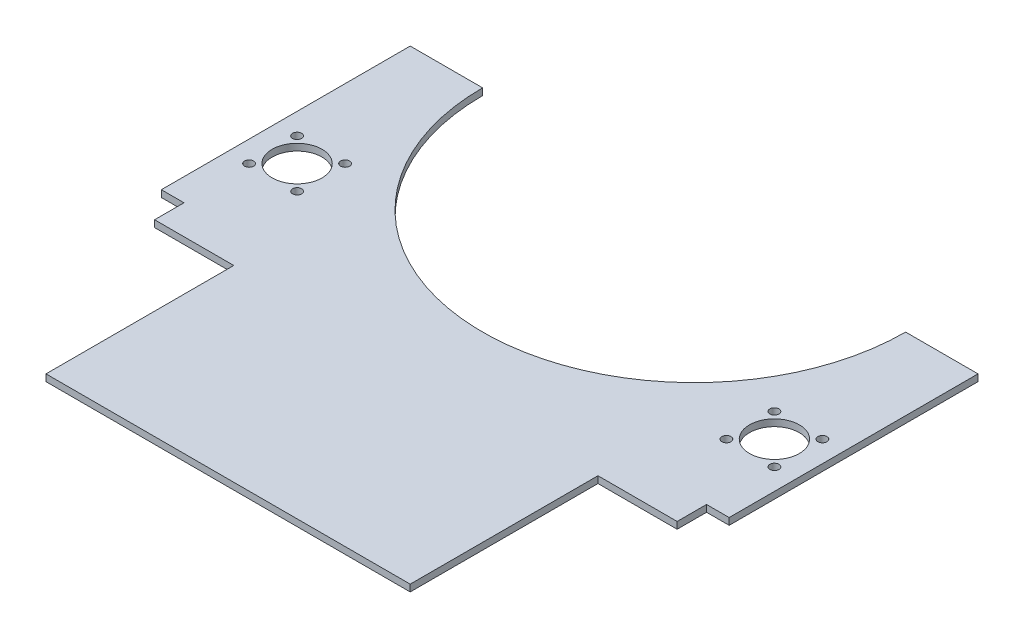
ISO-10303-21;
HEADER;
FILE_DESCRIPTION(('STEP AP214'),'2;1');
FILE_NAME('part.step','',(''),(''),'','','');
FILE_SCHEMA(('AUTOMOTIVE_DESIGN { 1 0 10303 214 1 1 1 1 }'));
ENDSEC;
DATA;
#1=APPLICATION_CONTEXT('core data for automotive mechanical design processes');
#2=APPLICATION_PROTOCOL_DEFINITION('international standard','automotive_design',2000,#1);
#3=PRODUCT_CONTEXT('',#1,'mechanical');
#4=PRODUCT('Part','Part','',(#3));
#5=PRODUCT_RELATED_PRODUCT_CATEGORY('part','',(#4));
#6=PRODUCT_DEFINITION_FORMATION('','',#4);
#7=PRODUCT_DEFINITION_CONTEXT('part definition',#1,'design');
#8=PRODUCT_DEFINITION('design','',#6,#7);
#9=PRODUCT_DEFINITION_SHAPE('','',#8);
#10=(LENGTH_UNIT() NAMED_UNIT(*) SI_UNIT(.MILLI.,.METRE.));
#11=(NAMED_UNIT(*) PLANE_ANGLE_UNIT() SI_UNIT($,.RADIAN.));
#12=(NAMED_UNIT(*) SI_UNIT($,.STERADIAN.) SOLID_ANGLE_UNIT());
#13=UNCERTAINTY_MEASURE_WITH_UNIT(LENGTH_MEASURE(1.E-05),#10,'distance_accuracy_value','');
#14=(GEOMETRIC_REPRESENTATION_CONTEXT(3) GLOBAL_UNCERTAINTY_ASSIGNED_CONTEXT((#13)) GLOBAL_UNIT_ASSIGNED_CONTEXT((#10,
#11,#12)) REPRESENTATION_CONTEXT('',''));
#15=CARTESIAN_POINT('',(0.,0.,0.));
#16=DIRECTION('',(0.,0.,1.));
#17=DIRECTION('',(1.,0.,0.));
#18=AXIS2_PLACEMENT_3D('',#15,#16,#17);
#19=CARTESIAN_POINT('',(0.,3.,-206.));
#20=DIRECTION('',(0.,-1.,0.));
#21=DIRECTION('',(0.,0.,-1.));
#22=AXIS2_PLACEMENT_3D('',#19,#20,#21);
#23=PLANE('',#22);
#24=CARTESIAN_POINT('',(116.11,3.,-146.61));
#25=DIRECTION('',(0.,1.,0.));
#26=DIRECTION('',(0.,0.,-1.));
#27=AXIS2_PLACEMENT_3D('',#24,#25,#26);
#28=CIRCLE('',#27,2.);
#29=CARTESIAN_POINT('',(116.11,3.,-148.61));
#30=VERTEX_POINT('',#29);
#31=EDGE_CURVE('E340',#30,#30,#28,.T.);
#32=ORIENTED_EDGE('',*,*,#31,.F.);
#33=EDGE_LOOP('',(#32));
#34=FACE_BOUND('',#33,.T.);
#35=CARTESIAN_POINT('',(94.8900000000001,3.,-125.39));
#36=DIRECTION('',(0.,1.,0.));
#37=DIRECTION('',(0.,0.,-1.));
#38=AXIS2_PLACEMENT_3D('',#35,#36,#37);
#39=CIRCLE('',#38,2.);
#40=CARTESIAN_POINT('',(94.8900000000001,3.,-127.39));
#41=VERTEX_POINT('',#40);
#42=EDGE_CURVE('E352',#41,#41,#39,.T.);
#43=ORIENTED_EDGE('',*,*,#42,.F.);
#44=EDGE_LOOP('',(#43));
#45=FACE_BOUND('',#44,.T.);
#46=CARTESIAN_POINT('',(-94.8900000000001,3.,-146.61));
#47=DIRECTION('',(0.,1.,0.));
#48=DIRECTION('',(0.,0.,-1.));
#49=AXIS2_PLACEMENT_3D('',#46,#47,#48);
#50=CIRCLE('',#49,2.);
#51=CARTESIAN_POINT('',(-94.8900000000001,3.,-148.61));
#52=VERTEX_POINT('',#51);
#53=EDGE_CURVE('E364',#52,#52,#50,.T.);
#54=ORIENTED_EDGE('',*,*,#53,.F.);
#55=EDGE_LOOP('',(#54));
#56=FACE_BOUND('',#55,.T.);
#57=CARTESIAN_POINT('',(-116.11,3.,-125.39));
#58=DIRECTION('',(0.,1.,0.));
#59=DIRECTION('',(0.,0.,-1.));
#60=AXIS2_PLACEMENT_3D('',#57,#58,#59);
#61=CIRCLE('',#60,2.);
#62=CARTESIAN_POINT('',(-116.11,3.,-127.39));
#63=VERTEX_POINT('',#62);
#64=EDGE_CURVE('E376',#63,#63,#61,.T.);
#65=ORIENTED_EDGE('',*,*,#64,.F.);
#66=EDGE_LOOP('',(#65));
#67=FACE_BOUND('',#66,.T.);
#68=CARTESIAN_POINT('',(-105.5,3.,-136.));
#69=DIRECTION('',(0.,1.,0.));
#70=DIRECTION('',(0.,0.,1.));
#71=AXIS2_PLACEMENT_3D('',#68,#69,#70);
#72=CIRCLE('',#71,11.);
#73=CARTESIAN_POINT('',(-105.5,3.,-125.));
#74=VERTEX_POINT('',#73);
#75=EDGE_CURVE('E168',#74,#74,#72,.T.);
#76=ORIENTED_EDGE('',*,*,#75,.F.);
#77=EDGE_LOOP('',(#76));
#78=FACE_BOUND('',#77,.T.);
#79=DIRECTION('',(0.,0.,-1.));
#80=VECTOR('',#79,1.);
#81=CARTESIAN_POINT('',(80.5,3.,0.));
#82=LINE('',#81,#80);
#83=CARTESIAN_POINT('',(80.5,3.,0.));
#84=VERTEX_POINT('',#83);
#85=CARTESIAN_POINT('',(80.5,3.,-83.));
#86=VERTEX_POINT('',#85);
#87=EDGE_CURVE('E191',#84,#86,#82,.T.);
#88=ORIENTED_EDGE('',*,*,#87,.T.);
#89=DIRECTION('',(1.,0.,0.));
#90=VECTOR('',#89,1.);
#91=CARTESIAN_POINT('',(80.5,3.,-83.));
#92=LINE('',#91,#90);
#93=CARTESIAN_POINT('',(115.5,3.,-83.));
#94=VERTEX_POINT('',#93);
#95=EDGE_CURVE('E109',#86,#94,#92,.T.);
#96=ORIENTED_EDGE('',*,*,#95,.T.);
#97=DIRECTION('',(0.,0.,-1.));
#98=VECTOR('',#97,1.);
#99=CARTESIAN_POINT('',(115.5,3.,-83.));
#100=LINE('',#99,#98);
#101=CARTESIAN_POINT('',(115.5,3.,-96.));
#102=VERTEX_POINT('',#101);
#103=EDGE_CURVE('E224',#94,#102,#100,.T.);
#104=ORIENTED_EDGE('',*,*,#103,.T.);
#105=DIRECTION('',(1.,0.,0.));
#106=VECTOR('',#105,1.);
#107=CARTESIAN_POINT('',(115.5,3.,-96.));
#108=LINE('',#107,#106);
#109=CARTESIAN_POINT('',(125.5,3.,-96.));
#110=VERTEX_POINT('',#109);
#111=EDGE_CURVE('E243',#102,#110,#108,.T.);
#112=ORIENTED_EDGE('',*,*,#111,.T.);
#113=DIRECTION('',(0.,0.,-1.));
#114=VECTOR('',#113,1.);
#115=CARTESIAN_POINT('',(125.5,3.,-96.));
#116=LINE('',#115,#114);
#117=CARTESIAN_POINT('',(125.5,3.,-206.));
#118=VERTEX_POINT('',#117);
#119=EDGE_CURVE('E240',#110,#118,#116,.T.);
#120=ORIENTED_EDGE('',*,*,#119,.T.);
#121=DIRECTION('',(-1.,0.,0.));
#122=VECTOR('',#121,1.);
#123=CARTESIAN_POINT('',(125.5,3.,-206.));
#124=LINE('',#123,#122);
#125=CARTESIAN_POINT('',(93.5000000000001,3.,-206.));
#126=VERTEX_POINT('',#125);
#127=EDGE_CURVE('E242',#118,#126,#124,.T.);
#128=ORIENTED_EDGE('',*,*,#127,.T.);
#129=CARTESIAN_POINT('',(0.,3.,-206.));
#130=DIRECTION('',(0.,-1.,0.));
#131=DIRECTION('',(0.,0.,-1.));
#132=AXIS2_PLACEMENT_3D('',#129,#130,#131);
#133=CIRCLE('',#132,93.5000000000001);
#134=CARTESIAN_POINT('',(-93.5000000000001,3.,-206.));
#135=VERTEX_POINT('',#134);
#136=EDGE_CURVE('E245',#126,#135,#133,.T.);
#137=ORIENTED_EDGE('',*,*,#136,.T.);
#138=DIRECTION('',(-1.,0.,0.));
#139=VECTOR('',#138,1.);
#140=CARTESIAN_POINT('',(-125.5,3.,-206.));
#141=LINE('',#140,#139);
#142=CARTESIAN_POINT('',(-125.5,3.,-206.));
#143=VERTEX_POINT('',#142);
#144=EDGE_CURVE('E251',#135,#143,#141,.T.);
#145=ORIENTED_EDGE('',*,*,#144,.T.);
#146=DIRECTION('',(0.,0.,1.));
#147=VECTOR('',#146,1.);
#148=CARTESIAN_POINT('',(-125.5,3.,-96.));
#149=LINE('',#148,#147);
#150=CARTESIAN_POINT('',(-125.5,3.,-96.));
#151=VERTEX_POINT('',#150);
#152=EDGE_CURVE('E253',#143,#151,#149,.T.);
#153=ORIENTED_EDGE('',*,*,#152,.T.);
#154=DIRECTION('',(1.,0.,0.));
#155=VECTOR('',#154,1.);
#156=CARTESIAN_POINT('',(-115.5,3.,-96.));
#157=LINE('',#156,#155);
#158=CARTESIAN_POINT('',(-115.5,3.,-96.));
#159=VERTEX_POINT('',#158);
#160=EDGE_CURVE('E255',#151,#159,#157,.T.);
#161=ORIENTED_EDGE('',*,*,#160,.T.);
#162=DIRECTION('',(0.,0.,1.));
#163=VECTOR('',#162,1.);
#164=CARTESIAN_POINT('',(-115.5,3.,-83.));
#165=LINE('',#164,#163);
#166=CARTESIAN_POINT('',(-115.5,3.,-83.));
#167=VERTEX_POINT('',#166);
#168=EDGE_CURVE('E146',#159,#167,#165,.T.);
#169=ORIENTED_EDGE('',*,*,#168,.T.);
#170=DIRECTION('',(1.,0.,0.));
#171=VECTOR('',#170,1.);
#172=CARTESIAN_POINT('',(-80.5,3.,-83.));
#173=LINE('',#172,#171);
#174=CARTESIAN_POINT('',(-80.5,3.,-83.));
#175=VERTEX_POINT('',#174);
#176=EDGE_CURVE('E140',#167,#175,#173,.T.);
#177=ORIENTED_EDGE('',*,*,#176,.T.);
#178=DIRECTION('',(0.,0.,1.));
#179=VECTOR('',#178,1.);
#180=CARTESIAN_POINT('',(-80.5,3.,0.));
#181=LINE('',#180,#179);
#182=CARTESIAN_POINT('',(-80.5,3.,0.));
#183=VERTEX_POINT('',#182);
#184=EDGE_CURVE('E144',#175,#183,#181,.T.);
#185=ORIENTED_EDGE('',*,*,#184,.T.);
#186=DIRECTION('',(1.,0.,0.));
#187=VECTOR('',#186,1.);
#188=CARTESIAN_POINT('',(80.5,3.,0.));
#189=LINE('',#188,#187);
#190=EDGE_CURVE('E48',#183,#84,#189,.T.);
#191=ORIENTED_EDGE('',*,*,#190,.T.);
#192=EDGE_LOOP('',(#88,#96,#104,#112,#120,#128,#137,#145,#153,#161,#169,#177,#185,#191));
#193=FACE_BOUND('',#192,.T.);
#194=CARTESIAN_POINT('',(-116.11,3.,-146.61));
#195=DIRECTION('',(0.,1.,0.));
#196=DIRECTION('',(0.,0.,1.));
#197=AXIS2_PLACEMENT_3D('',#194,#195,#196);
#198=CIRCLE('',#197,2.);
#199=CARTESIAN_POINT('',(-116.11,3.,-144.61));
#200=VERTEX_POINT('',#199);
#201=EDGE_CURVE('E382',#200,#200,#198,.T.);
#202=ORIENTED_EDGE('',*,*,#201,.F.);
#203=EDGE_LOOP('',(#202));
#204=FACE_BOUND('',#203,.T.);
#205=CARTESIAN_POINT('',(-94.8900000000001,3.,-125.39));
#206=DIRECTION('',(0.,1.,0.));
#207=DIRECTION('',(0.,0.,1.));
#208=AXIS2_PLACEMENT_3D('',#205,#206,#207);
#209=CIRCLE('',#208,2.);
#210=CARTESIAN_POINT('',(-94.8900000000001,3.,-123.39));
#211=VERTEX_POINT('',#210);
#212=EDGE_CURVE('E370',#211,#211,#209,.T.);
#213=ORIENTED_EDGE('',*,*,#212,.F.);
#214=EDGE_LOOP('',(#213));
#215=FACE_BOUND('',#214,.T.);
#216=CARTESIAN_POINT('',(94.89,3.,-146.61));
#217=DIRECTION('',(0.,1.,0.));
#218=DIRECTION('',(0.,0.,1.));
#219=AXIS2_PLACEMENT_3D('',#216,#217,#218);
#220=CIRCLE('',#219,2.);
#221=CARTESIAN_POINT('',(94.89,3.,-144.61));
#222=VERTEX_POINT('',#221);
#223=EDGE_CURVE('E358',#222,#222,#220,.T.);
#224=ORIENTED_EDGE('',*,*,#223,.F.);
#225=EDGE_LOOP('',(#224));
#226=FACE_BOUND('',#225,.T.);
#227=CARTESIAN_POINT('',(116.11,3.,-125.39));
#228=DIRECTION('',(0.,1.,0.));
#229=DIRECTION('',(0.,0.,1.));
#230=AXIS2_PLACEMENT_3D('',#227,#228,#229);
#231=CIRCLE('',#230,2.);
#232=CARTESIAN_POINT('',(116.11,3.,-123.39));
#233=VERTEX_POINT('',#232);
#234=EDGE_CURVE('E346',#233,#233,#231,.T.);
#235=ORIENTED_EDGE('',*,*,#234,.F.);
#236=EDGE_LOOP('',(#235));
#237=FACE_BOUND('',#236,.T.);
#238=CARTESIAN_POINT('',(105.5,3.,-136.));
#239=DIRECTION('',(0.,1.,0.));
#240=DIRECTION('',(0.,0.,-1.));
#241=AXIS2_PLACEMENT_3D('',#238,#239,#240);
#242=CIRCLE('',#241,11.);
#243=CARTESIAN_POINT('',(105.5,3.,-147.));
#244=VERTEX_POINT('',#243);
#245=EDGE_CURVE('E331',#244,#244,#242,.T.);
#246=ORIENTED_EDGE('',*,*,#245,.F.);
#247=EDGE_LOOP('',(#246));
#248=FACE_BOUND('',#247,.T.);
#249=ADVANCED_FACE('F31',(#34,#45,#56,#67,#78,#193,#204,#215,#226,#237,#248),#23,.F.);
#250=CARTESIAN_POINT('',(0.,0.,-206.));
#251=DIRECTION('',(0.,-1.,0.));
#252=DIRECTION('',(0.,0.,-1.));
#253=AXIS2_PLACEMENT_3D('',#250,#251,#252);
#254=PLANE('',#253);
#255=CARTESIAN_POINT('',(116.11,0.,-146.61));
#256=DIRECTION('',(0.,1.,0.));
#257=DIRECTION('',(0.,0.,-1.));
#258=AXIS2_PLACEMENT_3D('',#255,#256,#257);
#259=CIRCLE('',#258,2.);
#260=CARTESIAN_POINT('',(116.11,0.,-148.61));
#261=VERTEX_POINT('',#260);
#262=EDGE_CURVE('E337',#261,#261,#259,.T.);
#263=ORIENTED_EDGE('',*,*,#262,.T.);
#264=EDGE_LOOP('',(#263));
#265=FACE_BOUND('',#264,.T.);
#266=CARTESIAN_POINT('',(94.8900000000001,0.,-125.39));
#267=DIRECTION('',(0.,1.,0.));
#268=DIRECTION('',(0.,0.,-1.));
#269=AXIS2_PLACEMENT_3D('',#266,#267,#268);
#270=CIRCLE('',#269,2.);
#271=CARTESIAN_POINT('',(94.8900000000001,0.,-127.39));
#272=VERTEX_POINT('',#271);
#273=EDGE_CURVE('E349',#272,#272,#270,.T.);
#274=ORIENTED_EDGE('',*,*,#273,.T.);
#275=EDGE_LOOP('',(#274));
#276=FACE_BOUND('',#275,.T.);
#277=CARTESIAN_POINT('',(-94.8900000000001,0.,-146.61));
#278=DIRECTION('',(0.,1.,0.));
#279=DIRECTION('',(0.,0.,-1.));
#280=AXIS2_PLACEMENT_3D('',#277,#278,#279);
#281=CIRCLE('',#280,2.);
#282=CARTESIAN_POINT('',(-94.8900000000001,0.,-148.61));
#283=VERTEX_POINT('',#282);
#284=EDGE_CURVE('E361',#283,#283,#281,.T.);
#285=ORIENTED_EDGE('',*,*,#284,.T.);
#286=EDGE_LOOP('',(#285));
#287=FACE_BOUND('',#286,.T.);
#288=CARTESIAN_POINT('',(-116.11,0.,-125.39));
#289=DIRECTION('',(0.,1.,0.));
#290=DIRECTION('',(0.,0.,-1.));
#291=AXIS2_PLACEMENT_3D('',#288,#289,#290);
#292=CIRCLE('',#291,2.);
#293=CARTESIAN_POINT('',(-116.11,0.,-127.39));
#294=VERTEX_POINT('',#293);
#295=EDGE_CURVE('E373',#294,#294,#292,.T.);
#296=ORIENTED_EDGE('',*,*,#295,.T.);
#297=EDGE_LOOP('',(#296));
#298=FACE_BOUND('',#297,.T.);
#299=CARTESIAN_POINT('',(-105.5,0.,-136.));
#300=DIRECTION('',(0.,1.,0.));
#301=DIRECTION('',(0.,0.,1.));
#302=AXIS2_PLACEMENT_3D('',#299,#300,#301);
#303=CIRCLE('',#302,11.);
#304=CARTESIAN_POINT('',(-105.5,0.,-125.));
#305=VERTEX_POINT('',#304);
#306=EDGE_CURVE('E385',#305,#305,#303,.T.);
#307=ORIENTED_EDGE('',*,*,#306,.T.);
#308=EDGE_LOOP('',(#307));
#309=FACE_BOUND('',#308,.T.);
#310=DIRECTION('',(0.,0.,-1.));
#311=VECTOR('',#310,1.);
#312=CARTESIAN_POINT('',(80.5,0.,0.));
#313=LINE('',#312,#311);
#314=CARTESIAN_POINT('',(80.5,0.,0.));
#315=VERTEX_POINT('',#314);
#316=CARTESIAN_POINT('',(80.5,0.,-83.));
#317=VERTEX_POINT('',#316);
#318=EDGE_CURVE('E164',#315,#317,#313,.T.);
#319=ORIENTED_EDGE('',*,*,#318,.F.);
#320=DIRECTION('',(1.,0.,0.));
#321=VECTOR('',#320,1.);
#322=CARTESIAN_POINT('',(80.5,0.,0.));
#323=LINE('',#322,#321);
#324=CARTESIAN_POINT('',(-80.5,0.,0.));
#325=VERTEX_POINT('',#324);
#326=EDGE_CURVE('E101',#325,#315,#323,.T.);
#327=ORIENTED_EDGE('',*,*,#326,.F.);
#328=DIRECTION('',(0.,0.,1.));
#329=VECTOR('',#328,1.);
#330=CARTESIAN_POINT('',(-80.5,0.,0.));
#331=LINE('',#330,#329);
#332=CARTESIAN_POINT('',(-80.5,0.,-83.));
#333=VERTEX_POINT('',#332);
#334=EDGE_CURVE('E95',#333,#325,#331,.T.);
#335=ORIENTED_EDGE('',*,*,#334,.F.);
#336=DIRECTION('',(1.,0.,0.));
#337=VECTOR('',#336,1.);
#338=CARTESIAN_POINT('',(-80.5,0.,-83.));
#339=LINE('',#338,#337);
#340=CARTESIAN_POINT('',(-115.5,0.,-83.));
#341=VERTEX_POINT('',#340);
#342=EDGE_CURVE('E154',#341,#333,#339,.T.);
#343=ORIENTED_EDGE('',*,*,#342,.F.);
#344=DIRECTION('',(0.,0.,1.));
#345=VECTOR('',#344,1.);
#346=CARTESIAN_POINT('',(-115.5,0.,-83.));
#347=LINE('',#346,#345);
#348=CARTESIAN_POINT('',(-115.5,0.,-96.));
#349=VERTEX_POINT('',#348);
#350=EDGE_CURVE('E186',#349,#341,#347,.T.);
#351=ORIENTED_EDGE('',*,*,#350,.F.);
#352=DIRECTION('',(1.,0.,0.));
#353=VECTOR('',#352,1.);
#354=CARTESIAN_POINT('',(-115.5,0.,-96.));
#355=LINE('',#354,#353);
#356=CARTESIAN_POINT('',(-125.5,0.,-96.));
#357=VERTEX_POINT('',#356);
#358=EDGE_CURVE('E184',#357,#349,#355,.T.);
#359=ORIENTED_EDGE('',*,*,#358,.F.);
#360=DIRECTION('',(0.,0.,1.));
#361=VECTOR('',#360,1.);
#362=CARTESIAN_POINT('',(-125.5,0.,-96.));
#363=LINE('',#362,#361);
#364=CARTESIAN_POINT('',(-125.5,0.,-206.));
#365=VERTEX_POINT('',#364);
#366=EDGE_CURVE('E182',#365,#357,#363,.T.);
#367=ORIENTED_EDGE('',*,*,#366,.F.);
#368=DIRECTION('',(-1.,0.,0.));
#369=VECTOR('',#368,1.);
#370=CARTESIAN_POINT('',(-125.5,0.,-206.));
#371=LINE('',#370,#369);
#372=CARTESIAN_POINT('',(-93.5000000000001,0.,-206.));
#373=VERTEX_POINT('',#372);
#374=EDGE_CURVE('E180',#373,#365,#371,.T.);
#375=ORIENTED_EDGE('',*,*,#374,.F.);
#376=CARTESIAN_POINT('',(0.,0.,-206.));
#377=DIRECTION('',(0.,-1.,0.));
#378=DIRECTION('',(0.,0.,-1.));
#379=AXIS2_PLACEMENT_3D('',#376,#377,#378);
#380=CIRCLE('',#379,93.5000000000001);
#381=CARTESIAN_POINT('',(93.5000000000001,0.,-206.));
#382=VERTEX_POINT('',#381);
#383=EDGE_CURVE('E178',#382,#373,#380,.T.);
#384=ORIENTED_EDGE('',*,*,#383,.F.);
#385=DIRECTION('',(-1.,0.,0.));
#386=VECTOR('',#385,1.);
#387=CARTESIAN_POINT('',(125.5,0.,-206.));
#388=LINE('',#387,#386);
#389=CARTESIAN_POINT('',(125.5,0.,-206.));
#390=VERTEX_POINT('',#389);
#391=EDGE_CURVE('E176',#390,#382,#388,.T.);
#392=ORIENTED_EDGE('',*,*,#391,.F.);
#393=DIRECTION('',(0.,0.,-1.));
#394=VECTOR('',#393,1.);
#395=CARTESIAN_POINT('',(125.5,0.,-96.));
#396=LINE('',#395,#394);
#397=CARTESIAN_POINT('',(125.5,0.,-96.));
#398=VERTEX_POINT('',#397);
#399=EDGE_CURVE('E174',#398,#390,#396,.T.);
#400=ORIENTED_EDGE('',*,*,#399,.F.);
#401=DIRECTION('',(1.,0.,0.));
#402=VECTOR('',#401,1.);
#403=CARTESIAN_POINT('',(115.5,0.,-96.));
#404=LINE('',#403,#402);
#405=CARTESIAN_POINT('',(115.5,0.,-96.));
#406=VERTEX_POINT('',#405);
#407=EDGE_CURVE('E172',#406,#398,#404,.T.);
#408=ORIENTED_EDGE('',*,*,#407,.F.);
#409=DIRECTION('',(0.,0.,-1.));
#410=VECTOR('',#409,1.);
#411=CARTESIAN_POINT('',(115.5,0.,-83.));
#412=LINE('',#411,#410);
#413=CARTESIAN_POINT('',(115.5,0.,-83.));
#414=VERTEX_POINT('',#413);
#415=EDGE_CURVE('E170',#414,#406,#412,.T.);
#416=ORIENTED_EDGE('',*,*,#415,.F.);
#417=DIRECTION('',(1.,0.,0.));
#418=VECTOR('',#417,1.);
#419=CARTESIAN_POINT('',(80.5,0.,-83.));
#420=LINE('',#419,#418);
#421=EDGE_CURVE('E167',#317,#414,#420,.T.);
#422=ORIENTED_EDGE('',*,*,#421,.F.);
#423=EDGE_LOOP('',(#319,#327,#335,#343,#351,#359,#367,#375,#384,#392,#400,#408,#416,#422));
#424=FACE_BOUND('',#423,.T.);
#425=CARTESIAN_POINT('',(-116.11,0.,-146.61));
#426=DIRECTION('',(0.,1.,0.));
#427=DIRECTION('',(0.,0.,1.));
#428=AXIS2_PLACEMENT_3D('',#425,#426,#427);
#429=CIRCLE('',#428,2.);
#430=CARTESIAN_POINT('',(-116.11,0.,-144.61));
#431=VERTEX_POINT('',#430);
#432=EDGE_CURVE('E379',#431,#431,#429,.T.);
#433=ORIENTED_EDGE('',*,*,#432,.T.);
#434=EDGE_LOOP('',(#433));
#435=FACE_BOUND('',#434,.T.);
#436=CARTESIAN_POINT('',(-94.8900000000001,0.,-125.39));
#437=DIRECTION('',(0.,1.,0.));
#438=DIRECTION('',(0.,0.,1.));
#439=AXIS2_PLACEMENT_3D('',#436,#437,#438);
#440=CIRCLE('',#439,2.);
#441=CARTESIAN_POINT('',(-94.8900000000001,0.,-123.39));
#442=VERTEX_POINT('',#441);
#443=EDGE_CURVE('E367',#442,#442,#440,.T.);
#444=ORIENTED_EDGE('',*,*,#443,.T.);
#445=EDGE_LOOP('',(#444));
#446=FACE_BOUND('',#445,.T.);
#447=CARTESIAN_POINT('',(94.89,0.,-146.61));
#448=DIRECTION('',(0.,1.,0.));
#449=DIRECTION('',(0.,0.,1.));
#450=AXIS2_PLACEMENT_3D('',#447,#448,#449);
#451=CIRCLE('',#450,2.);
#452=CARTESIAN_POINT('',(94.89,0.,-144.61));
#453=VERTEX_POINT('',#452);
#454=EDGE_CURVE('E355',#453,#453,#451,.T.);
#455=ORIENTED_EDGE('',*,*,#454,.T.);
#456=EDGE_LOOP('',(#455));
#457=FACE_BOUND('',#456,.T.);
#458=CARTESIAN_POINT('',(116.11,0.,-125.39));
#459=DIRECTION('',(0.,1.,0.));
#460=DIRECTION('',(0.,0.,1.));
#461=AXIS2_PLACEMENT_3D('',#458,#459,#460);
#462=CIRCLE('',#461,2.);
#463=CARTESIAN_POINT('',(116.11,0.,-123.39));
#464=VERTEX_POINT('',#463);
#465=EDGE_CURVE('E343',#464,#464,#462,.T.);
#466=ORIENTED_EDGE('',*,*,#465,.T.);
#467=EDGE_LOOP('',(#466));
#468=FACE_BOUND('',#467,.T.);
#469=CARTESIAN_POINT('',(105.5,0.,-136.));
#470=DIRECTION('',(0.,1.,0.));
#471=DIRECTION('',(0.,0.,-1.));
#472=AXIS2_PLACEMENT_3D('',#469,#470,#471);
#473=CIRCLE('',#472,11.);
#474=CARTESIAN_POINT('',(105.5,0.,-147.));
#475=VERTEX_POINT('',#474);
#476=EDGE_CURVE('E334',#475,#475,#473,.T.);
#477=ORIENTED_EDGE('',*,*,#476,.T.);
#478=EDGE_LOOP('',(#477));
#479=FACE_BOUND('',#478,.T.);
#480=ADVANCED_FACE('F228',(#265,#276,#287,#298,#309,#424,#435,#446,#457,#468,#479),#254,.T.);
#481=CARTESIAN_POINT('',(80.5,3.,0.));
#482=DIRECTION('',(-1.,0.,0.));
#483=DIRECTION('',(0.,0.,1.));
#484=AXIS2_PLACEMENT_3D('',#481,#482,#483);
#485=PLANE('',#484);
#486=ORIENTED_EDGE('',*,*,#318,.T.);
#487=DIRECTION('',(0.,-1.,0.));
#488=VECTOR('',#487,1.);
#489=CARTESIAN_POINT('',(80.5,3.,-83.));
#490=LINE('',#489,#488);
#491=EDGE_CURVE('E11',#86,#317,#490,.T.);
#492=ORIENTED_EDGE('',*,*,#491,.F.);
#493=ORIENTED_EDGE('',*,*,#87,.F.);
#494=DIRECTION('',(0.,-1.,0.));
#495=VECTOR('',#494,1.);
#496=CARTESIAN_POINT('',(80.5,3.,0.));
#497=LINE('',#496,#495);
#498=EDGE_CURVE('E160',#84,#315,#497,.T.);
#499=ORIENTED_EDGE('',*,*,#498,.T.);
#500=EDGE_LOOP('',(#486,#492,#493,#499));
#501=FACE_BOUND('',#500,.T.);
#502=ADVANCED_FACE('F33',(#501),#485,.F.);
#503=CARTESIAN_POINT('',(80.5,3.,-83.));
#504=DIRECTION('',(0.,0.,-1.));
#505=DIRECTION('',(-1.,0.,0.));
#506=AXIS2_PLACEMENT_3D('',#503,#504,#505);
#507=PLANE('',#506);
#508=ORIENTED_EDGE('',*,*,#421,.T.);
#509=DIRECTION('',(0.,-1.,0.));
#510=VECTOR('',#509,1.);
#511=CARTESIAN_POINT('',(115.5,3.,-83.));
#512=LINE('',#511,#510);
#513=EDGE_CURVE('E40',#94,#414,#512,.T.);
#514=ORIENTED_EDGE('',*,*,#513,.F.);
#515=ORIENTED_EDGE('',*,*,#95,.F.);
#516=ORIENTED_EDGE('',*,*,#491,.T.);
#517=EDGE_LOOP('',(#508,#514,#515,#516));
#518=FACE_BOUND('',#517,.T.);
#519=ADVANCED_FACE('F568',(#518),#507,.F.);
#520=CARTESIAN_POINT('',(115.5,3.,-83.));
#521=DIRECTION('',(-1.,0.,0.));
#522=DIRECTION('',(0.,0.,1.));
#523=AXIS2_PLACEMENT_3D('',#520,#521,#522);
#524=PLANE('',#523);
#525=ORIENTED_EDGE('',*,*,#415,.T.);
#526=DIRECTION('',(0.,-1.,0.));
#527=VECTOR('',#526,1.);
#528=CARTESIAN_POINT('',(115.5,3.,-96.));
#529=LINE('',#528,#527);
#530=EDGE_CURVE('E216',#102,#406,#529,.T.);
#531=ORIENTED_EDGE('',*,*,#530,.F.);
#532=ORIENTED_EDGE('',*,*,#103,.F.);
#533=ORIENTED_EDGE('',*,*,#513,.T.);
#534=EDGE_LOOP('',(#525,#531,#532,#533));
#535=FACE_BOUND('',#534,.T.);
#536=ADVANCED_FACE('F222',(#535),#524,.F.);
#537=CARTESIAN_POINT('',(115.5,3.,-96.));
#538=DIRECTION('',(0.,0.,-1.));
#539=DIRECTION('',(-1.,0.,0.));
#540=AXIS2_PLACEMENT_3D('',#537,#538,#539);
#541=PLANE('',#540);
#542=ORIENTED_EDGE('',*,*,#407,.T.);
#543=DIRECTION('',(0.,-1.,0.));
#544=VECTOR('',#543,1.);
#545=CARTESIAN_POINT('',(125.5,3.,-96.));
#546=LINE('',#545,#544);
#547=EDGE_CURVE('E213',#110,#398,#546,.T.);
#548=ORIENTED_EDGE('',*,*,#547,.F.);
#549=ORIENTED_EDGE('',*,*,#111,.F.);
#550=ORIENTED_EDGE('',*,*,#530,.T.);
#551=EDGE_LOOP('',(#542,#548,#549,#550));
#552=FACE_BOUND('',#551,.T.);
#553=ADVANCED_FACE('F234',(#552),#541,.F.);
#554=CARTESIAN_POINT('',(125.5,3.,-96.));
#555=DIRECTION('',(-1.,0.,0.));
#556=DIRECTION('',(0.,0.,1.));
#557=AXIS2_PLACEMENT_3D('',#554,#555,#556);
#558=PLANE('',#557);
#559=ORIENTED_EDGE('',*,*,#399,.T.);
#560=DIRECTION('',(0.,-1.,0.));
#561=VECTOR('',#560,1.);
#562=CARTESIAN_POINT('',(125.5,3.,-206.));
#563=LINE('',#562,#561);
#564=EDGE_CURVE('E210',#118,#390,#563,.T.);
#565=ORIENTED_EDGE('',*,*,#564,.F.);
#566=ORIENTED_EDGE('',*,*,#119,.F.);
#567=ORIENTED_EDGE('',*,*,#547,.T.);
#568=EDGE_LOOP('',(#559,#565,#566,#567));
#569=FACE_BOUND('',#568,.T.);
#570=ADVANCED_FACE('F238',(#569),#558,.F.);
#571=CARTESIAN_POINT('',(125.5,3.,-206.));
#572=DIRECTION('',(0.,0.,1.));
#573=DIRECTION('',(1.,0.,0.));
#574=AXIS2_PLACEMENT_3D('',#571,#572,#573);
#575=PLANE('',#574);
#576=ORIENTED_EDGE('',*,*,#391,.T.);
#577=DIRECTION('',(0.,-1.,0.));
#578=VECTOR('',#577,1.);
#579=CARTESIAN_POINT('',(93.5000000000001,3.,-206.));
#580=LINE('',#579,#578);
#581=EDGE_CURVE('E207',#126,#382,#580,.T.);
#582=ORIENTED_EDGE('',*,*,#581,.F.);
#583=ORIENTED_EDGE('',*,*,#127,.F.);
#584=ORIENTED_EDGE('',*,*,#564,.T.);
#585=EDGE_LOOP('',(#576,#582,#583,#584));
#586=FACE_BOUND('',#585,.T.);
#587=ADVANCED_FACE('F533',(#586),#575,.F.);
#588=CARTESIAN_POINT('',(0.,3.,-206.));
#589=DIRECTION('',(0.,-1.,0.));
#590=DIRECTION('',(0.,0.,-1.));
#591=AXIS2_PLACEMENT_3D('',#588,#589,#590);
#592=CYLINDRICAL_SURFACE('',#591,93.5000000000001);
#593=ORIENTED_EDGE('',*,*,#383,.T.);
#594=DIRECTION('',(0.,-1.,0.));
#595=VECTOR('',#594,1.);
#596=CARTESIAN_POINT('',(-93.5000000000001,3.,-206.));
#597=LINE('',#596,#595);
#598=EDGE_CURVE('E204',#135,#373,#597,.T.);
#599=ORIENTED_EDGE('',*,*,#598,.F.);
#600=ORIENTED_EDGE('',*,*,#136,.F.);
#601=ORIENTED_EDGE('',*,*,#581,.T.);
#602=EDGE_LOOP('',(#593,#599,#600,#601));
#603=FACE_BOUND('',#602,.T.);
#604=ADVANCED_FACE('F523',(#603),#592,.F.);
#605=CARTESIAN_POINT('',(-125.5,3.,-206.));
#606=DIRECTION('',(0.,0.,1.));
#607=DIRECTION('',(1.,0.,0.));
#608=AXIS2_PLACEMENT_3D('',#605,#606,#607);
#609=PLANE('',#608);
#610=ORIENTED_EDGE('',*,*,#374,.T.);
#611=DIRECTION('',(0.,-1.,0.));
#612=VECTOR('',#611,1.);
#613=CARTESIAN_POINT('',(-125.5,3.,-206.));
#614=LINE('',#613,#612);
#615=EDGE_CURVE('E201',#143,#365,#614,.T.);
#616=ORIENTED_EDGE('',*,*,#615,.F.);
#617=ORIENTED_EDGE('',*,*,#144,.F.);
#618=ORIENTED_EDGE('',*,*,#598,.T.);
#619=EDGE_LOOP('',(#610,#616,#617,#618));
#620=FACE_BOUND('',#619,.T.);
#621=ADVANCED_FACE('F513',(#620),#609,.F.);
#622=CARTESIAN_POINT('',(-125.5,3.,-96.));
#623=DIRECTION('',(1.,0.,0.));
#624=DIRECTION('',(0.,0.,-1.));
#625=AXIS2_PLACEMENT_3D('',#622,#623,#624);
#626=PLANE('',#625);
#627=ORIENTED_EDGE('',*,*,#366,.T.);
#628=DIRECTION('',(0.,-1.,0.));
#629=VECTOR('',#628,1.);
#630=CARTESIAN_POINT('',(-125.5,3.,-96.));
#631=LINE('',#630,#629);
#632=EDGE_CURVE('E198',#151,#357,#631,.T.);
#633=ORIENTED_EDGE('',*,*,#632,.F.);
#634=ORIENTED_EDGE('',*,*,#152,.F.);
#635=ORIENTED_EDGE('',*,*,#615,.T.);
#636=EDGE_LOOP('',(#627,#633,#634,#635));
#637=FACE_BOUND('',#636,.T.);
#638=ADVANCED_FACE('F504',(#637),#626,.F.);
#639=CARTESIAN_POINT('',(-115.5,3.,-96.));
#640=DIRECTION('',(0.,0.,-1.));
#641=DIRECTION('',(-1.,0.,0.));
#642=AXIS2_PLACEMENT_3D('',#639,#640,#641);
#643=PLANE('',#642);
#644=ORIENTED_EDGE('',*,*,#358,.T.);
#645=DIRECTION('',(0.,-1.,0.));
#646=VECTOR('',#645,1.);
#647=CARTESIAN_POINT('',(-115.5,3.,-96.));
#648=LINE('',#647,#646);
#649=EDGE_CURVE('E195',#159,#349,#648,.T.);
#650=ORIENTED_EDGE('',*,*,#649,.F.);
#651=ORIENTED_EDGE('',*,*,#160,.F.);
#652=ORIENTED_EDGE('',*,*,#632,.T.);
#653=EDGE_LOOP('',(#644,#650,#651,#652));
#654=FACE_BOUND('',#653,.T.);
#655=ADVANCED_FACE('F261',(#654),#643,.F.);
#656=CARTESIAN_POINT('',(-115.5,3.,-83.));
#657=DIRECTION('',(1.,0.,0.));
#658=DIRECTION('',(0.,0.,-1.));
#659=AXIS2_PLACEMENT_3D('',#656,#657,#658);
#660=PLANE('',#659);
#661=ORIENTED_EDGE('',*,*,#350,.T.);
#662=DIRECTION('',(0.,-1.,0.));
#663=VECTOR('',#662,1.);
#664=CARTESIAN_POINT('',(-115.5,3.,-83.));
#665=LINE('',#664,#663);
#666=EDGE_CURVE('E155',#167,#341,#665,.T.);
#667=ORIENTED_EDGE('',*,*,#666,.F.);
#668=ORIENTED_EDGE('',*,*,#168,.F.);
#669=ORIENTED_EDGE('',*,*,#649,.T.);
#670=EDGE_LOOP('',(#661,#667,#668,#669));
#671=FACE_BOUND('',#670,.T.);
#672=ADVANCED_FACE('F265',(#671),#660,.F.);
#673=CARTESIAN_POINT('',(-80.5,3.,-83.));
#674=DIRECTION('',(0.,0.,-1.));
#675=DIRECTION('',(-1.,0.,0.));
#676=AXIS2_PLACEMENT_3D('',#673,#674,#675);
#677=PLANE('',#676);
#678=ORIENTED_EDGE('',*,*,#342,.T.);
#679=DIRECTION('',(0.,-1.,0.));
#680=VECTOR('',#679,1.);
#681=CARTESIAN_POINT('',(-80.5,3.,-83.));
#682=LINE('',#681,#680);
#683=EDGE_CURVE('E151',#175,#333,#682,.T.);
#684=ORIENTED_EDGE('',*,*,#683,.F.);
#685=ORIENTED_EDGE('',*,*,#176,.F.);
#686=ORIENTED_EDGE('',*,*,#666,.T.);
#687=EDGE_LOOP('',(#678,#684,#685,#686));
#688=FACE_BOUND('',#687,.T.);
#689=ADVANCED_FACE('F152',(#688),#677,.F.);
#690=CARTESIAN_POINT('',(-80.5,3.,0.));
#691=DIRECTION('',(1.,0.,0.));
#692=DIRECTION('',(0.,0.,-1.));
#693=AXIS2_PLACEMENT_3D('',#690,#691,#692);
#694=PLANE('',#693);
#695=ORIENTED_EDGE('',*,*,#334,.T.);
#696=DIRECTION('',(0.,-1.,0.));
#697=VECTOR('',#696,1.);
#698=CARTESIAN_POINT('',(-80.5,3.,0.));
#699=LINE('',#698,#697);
#700=EDGE_CURVE('E156',#183,#325,#699,.T.);
#701=ORIENTED_EDGE('',*,*,#700,.F.);
#702=ORIENTED_EDGE('',*,*,#184,.F.);
#703=ORIENTED_EDGE('',*,*,#683,.T.);
#704=EDGE_LOOP('',(#695,#701,#702,#703));
#705=FACE_BOUND('',#704,.T.);
#706=ADVANCED_FACE('F158',(#705),#694,.F.);
#707=CARTESIAN_POINT('',(80.5,3.,0.));
#708=DIRECTION('',(0.,0.,-1.));
#709=DIRECTION('',(-1.,0.,0.));
#710=AXIS2_PLACEMENT_3D('',#707,#708,#709);
#711=PLANE('',#710);
#712=ORIENTED_EDGE('',*,*,#326,.T.);
#713=ORIENTED_EDGE('',*,*,#498,.F.);
#714=ORIENTED_EDGE('',*,*,#190,.F.);
#715=ORIENTED_EDGE('',*,*,#700,.T.);
#716=EDGE_LOOP('',(#712,#713,#714,#715));
#717=FACE_BOUND('',#716,.T.);
#718=ADVANCED_FACE('F269',(#717),#711,.F.);
#719=CARTESIAN_POINT('',(-105.5,3.,-136.));
#720=DIRECTION('',(0.,-1.,0.));
#721=DIRECTION('',(0.,0.,-1.));
#722=AXIS2_PLACEMENT_3D('',#719,#720,#721);
#723=CYLINDRICAL_SURFACE('',#722,11.);
#724=ORIENTED_EDGE('',*,*,#75,.T.);
#725=EDGE_LOOP('',(#724));
#726=FACE_BOUND('',#725,.T.);
#727=ORIENTED_EDGE('',*,*,#306,.F.);
#728=EDGE_LOOP('',(#727));
#729=FACE_BOUND('',#728,.T.);
#730=ADVANCED_FACE('F271',(#726,#729),#723,.F.);
#731=CARTESIAN_POINT('',(-116.11,3.,-146.61));
#732=DIRECTION('',(0.,-1.,0.));
#733=DIRECTION('',(0.,0.,-1.));
#734=AXIS2_PLACEMENT_3D('',#731,#732,#733);
#735=CYLINDRICAL_SURFACE('',#734,2.);
#736=ORIENTED_EDGE('',*,*,#201,.T.);
#737=EDGE_LOOP('',(#736));
#738=FACE_BOUND('',#737,.T.);
#739=ORIENTED_EDGE('',*,*,#432,.F.);
#740=EDGE_LOOP('',(#739));
#741=FACE_BOUND('',#740,.T.);
#742=ADVANCED_FACE('F277',(#738,#741),#735,.F.);
#743=CARTESIAN_POINT('',(-116.11,3.,-125.39));
#744=DIRECTION('',(0.,-1.,0.));
#745=DIRECTION('',(0.,0.,-1.));
#746=AXIS2_PLACEMENT_3D('',#743,#744,#745);
#747=CYLINDRICAL_SURFACE('',#746,2.);
#748=ORIENTED_EDGE('',*,*,#64,.T.);
#749=EDGE_LOOP('',(#748));
#750=FACE_BOUND('',#749,.T.);
#751=ORIENTED_EDGE('',*,*,#295,.F.);
#752=EDGE_LOOP('',(#751));
#753=FACE_BOUND('',#752,.T.);
#754=ADVANCED_FACE('F294',(#750,#753),#747,.F.);
#755=CARTESIAN_POINT('',(-94.8900000000001,3.,-125.39));
#756=DIRECTION('',(0.,-1.,0.));
#757=DIRECTION('',(0.,0.,-1.));
#758=AXIS2_PLACEMENT_3D('',#755,#756,#757);
#759=CYLINDRICAL_SURFACE('',#758,2.);
#760=ORIENTED_EDGE('',*,*,#212,.T.);
#761=EDGE_LOOP('',(#760));
#762=FACE_BOUND('',#761,.T.);
#763=ORIENTED_EDGE('',*,*,#443,.F.);
#764=EDGE_LOOP('',(#763));
#765=FACE_BOUND('',#764,.T.);
#766=ADVANCED_FACE('F298',(#762,#765),#759,.F.);
#767=CARTESIAN_POINT('',(-94.8900000000001,3.,-146.61));
#768=DIRECTION('',(0.,-1.,0.));
#769=DIRECTION('',(0.,0.,-1.));
#770=AXIS2_PLACEMENT_3D('',#767,#768,#769);
#771=CYLINDRICAL_SURFACE('',#770,2.);
#772=ORIENTED_EDGE('',*,*,#53,.T.);
#773=EDGE_LOOP('',(#772));
#774=FACE_BOUND('',#773,.T.);
#775=ORIENTED_EDGE('',*,*,#284,.F.);
#776=EDGE_LOOP('',(#775));
#777=FACE_BOUND('',#776,.T.);
#778=ADVANCED_FACE('F302',(#774,#777),#771,.F.);
#779=CARTESIAN_POINT('',(94.89,3.,-146.61));
#780=DIRECTION('',(0.,-1.,0.));
#781=DIRECTION('',(0.,0.,-1.));
#782=AXIS2_PLACEMENT_3D('',#779,#780,#781);
#783=CYLINDRICAL_SURFACE('',#782,2.);
#784=ORIENTED_EDGE('',*,*,#223,.T.);
#785=EDGE_LOOP('',(#784));
#786=FACE_BOUND('',#785,.T.);
#787=ORIENTED_EDGE('',*,*,#454,.F.);
#788=EDGE_LOOP('',(#787));
#789=FACE_BOUND('',#788,.T.);
#790=ADVANCED_FACE('F306',(#786,#789),#783,.F.);
#791=CARTESIAN_POINT('',(94.8900000000001,3.,-125.39));
#792=DIRECTION('',(0.,-1.,0.));
#793=DIRECTION('',(0.,0.,-1.));
#794=AXIS2_PLACEMENT_3D('',#791,#792,#793);
#795=CYLINDRICAL_SURFACE('',#794,2.);
#796=ORIENTED_EDGE('',*,*,#42,.T.);
#797=EDGE_LOOP('',(#796));
#798=FACE_BOUND('',#797,.T.);
#799=ORIENTED_EDGE('',*,*,#273,.F.);
#800=EDGE_LOOP('',(#799));
#801=FACE_BOUND('',#800,.T.);
#802=ADVANCED_FACE('F310',(#798,#801),#795,.F.);
#803=CARTESIAN_POINT('',(116.11,3.,-125.39));
#804=DIRECTION('',(0.,-1.,0.));
#805=DIRECTION('',(0.,0.,-1.));
#806=AXIS2_PLACEMENT_3D('',#803,#804,#805);
#807=CYLINDRICAL_SURFACE('',#806,2.);
#808=ORIENTED_EDGE('',*,*,#234,.T.);
#809=EDGE_LOOP('',(#808));
#810=FACE_BOUND('',#809,.T.);
#811=ORIENTED_EDGE('',*,*,#465,.F.);
#812=EDGE_LOOP('',(#811));
#813=FACE_BOUND('',#812,.T.);
#814=ADVANCED_FACE('F314',(#810,#813),#807,.F.);
#815=CARTESIAN_POINT('',(116.11,3.,-146.61));
#816=DIRECTION('',(0.,-1.,0.));
#817=DIRECTION('',(0.,0.,-1.));
#818=AXIS2_PLACEMENT_3D('',#815,#816,#817);
#819=CYLINDRICAL_SURFACE('',#818,2.);
#820=ORIENTED_EDGE('',*,*,#31,.T.);
#821=EDGE_LOOP('',(#820));
#822=FACE_BOUND('',#821,.T.);
#823=ORIENTED_EDGE('',*,*,#262,.F.);
#824=EDGE_LOOP('',(#823));
#825=FACE_BOUND('',#824,.T.);
#826=ADVANCED_FACE('F318',(#822,#825),#819,.F.);
#827=CARTESIAN_POINT('',(105.5,3.,-136.));
#828=DIRECTION('',(0.,-1.,0.));
#829=DIRECTION('',(0.,0.,-1.));
#830=AXIS2_PLACEMENT_3D('',#827,#828,#829);
#831=CYLINDRICAL_SURFACE('',#830,11.);
#832=ORIENTED_EDGE('',*,*,#245,.T.);
#833=EDGE_LOOP('',(#832));
#834=FACE_BOUND('',#833,.T.);
#835=ORIENTED_EDGE('',*,*,#476,.F.);
#836=EDGE_LOOP('',(#835));
#837=FACE_BOUND('',#836,.T.);
#838=ADVANCED_FACE('F322',(#834,#837),#831,.F.);
#839=CLOSED_SHELL('',(#249,#480,#502,#519,#536,#553,#570,#587,#604,#621,#638,#655,#672,#689,
#706,#718,#730,#742,#754,#766,#778,#790,#802,#814,#826,#838));
#840=MANIFOLD_SOLID_BREP('B2',#839);
#841=ADVANCED_BREP_SHAPE_REPRESENTATION('',(#18,#840),#14);
#842=SHAPE_DEFINITION_REPRESENTATION(#9,#841);
ENDSEC;
END-ISO-10303-21;
